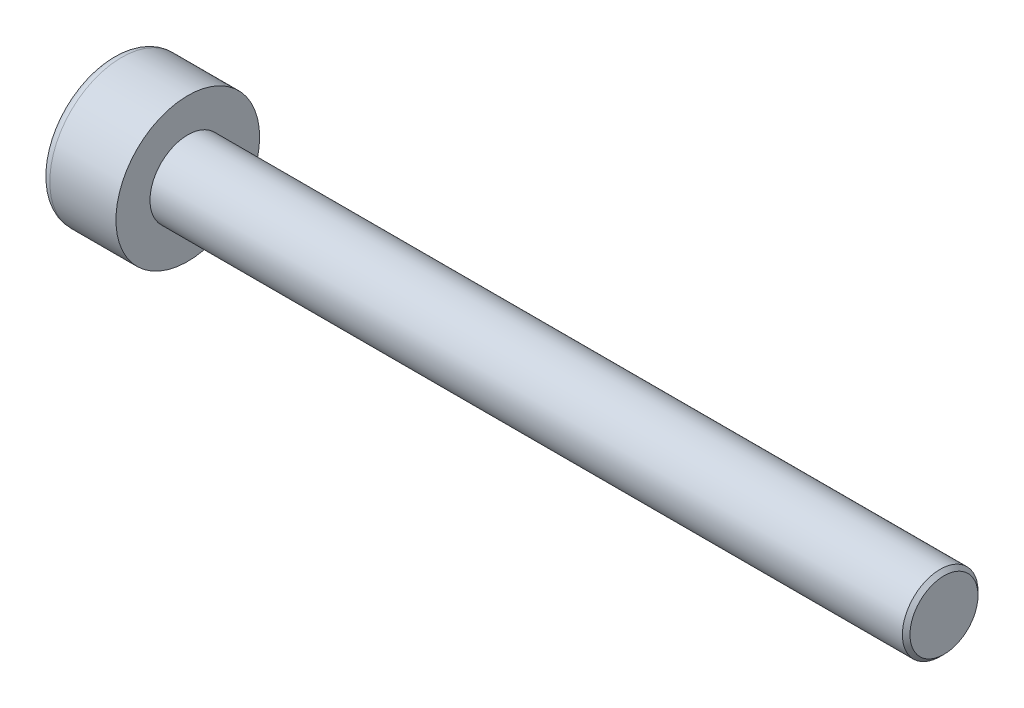
ISO-10303-21;
HEADER;
FILE_DESCRIPTION(('STEP AP214'),'2;1');
FILE_NAME('part.step','',(''),(''),'','','');
FILE_SCHEMA(('AUTOMOTIVE_DESIGN { 1 0 10303 214 1 1 1 1 }'));
ENDSEC;
DATA;
#1=APPLICATION_CONTEXT('core data for automotive mechanical design processes');
#2=APPLICATION_PROTOCOL_DEFINITION('international standard','automotive_design',2000,#1);
#3=PRODUCT_CONTEXT('',#1,'mechanical');
#4=PRODUCT('Part','Part','',(#3));
#5=PRODUCT_RELATED_PRODUCT_CATEGORY('part','',(#4));
#6=PRODUCT_DEFINITION_FORMATION('','',#4);
#7=PRODUCT_DEFINITION_CONTEXT('part definition',#1,'design');
#8=PRODUCT_DEFINITION('design','',#6,#7);
#9=PRODUCT_DEFINITION_SHAPE('','',#8);
#10=(LENGTH_UNIT() NAMED_UNIT(*) SI_UNIT(.MILLI.,.METRE.));
#11=(NAMED_UNIT(*) PLANE_ANGLE_UNIT() SI_UNIT($,.RADIAN.));
#12=(NAMED_UNIT(*) SI_UNIT($,.STERADIAN.) SOLID_ANGLE_UNIT());
#13=UNCERTAINTY_MEASURE_WITH_UNIT(LENGTH_MEASURE(1.E-05),#10,'distance_accuracy_value','');
#14=(GEOMETRIC_REPRESENTATION_CONTEXT(3) GLOBAL_UNCERTAINTY_ASSIGNED_CONTEXT((#13)) GLOBAL_UNIT_ASSIGNED_CONTEXT((#10,
#11,#12)) REPRESENTATION_CONTEXT('',''));
#15=CARTESIAN_POINT('',(0.,0.,0.));
#16=DIRECTION('',(0.,0.,1.));
#17=DIRECTION('',(1.,0.,0.));
#18=AXIS2_PLACEMENT_3D('',#15,#16,#17);
#19=CARTESIAN_POINT('',(1.,-1.5,0.));
#20=DIRECTION('',(-1.,0.,0.));
#21=DIRECTION('',(0.,0.,1.));
#22=AXIS2_PLACEMENT_3D('',#19,#20,#21);
#23=PLANE('',#22);
#24=DIRECTION('',(0.,-0.866025403784438,-0.500000000000001));
#25=VECTOR('',#24,1.);
#26=CARTESIAN_POINT('',(1.,0.,0.866025403784438));
#27=LINE('',#26,#25);
#28=CARTESIAN_POINT('',(1.,-0.375,0.649519052838328));
#29=VERTEX_POINT('',#28);
#30=CARTESIAN_POINT('',(1.,-0.749999999999999,0.433012701892218));
#31=VERTEX_POINT('',#30);
#32=EDGE_CURVE('E163',#29,#31,#27,.T.);
#33=ORIENTED_EDGE('',*,*,#32,.F.);
#34=CARTESIAN_POINT('',(1.,0.,0.));
#35=DIRECTION('',(-1.,0.,0.));
#36=DIRECTION('',(0.,0.,1.));
#37=AXIS2_PLACEMENT_3D('',#34,#35,#36);
#38=CIRCLE('',#37,0.749999999999999);
#39=CARTESIAN_POINT('',(1.,-0.749999999999999,0.));
#40=VERTEX_POINT('',#39);
#41=EDGE_CURVE('E58',#29,#40,#38,.F.);
#42=ORIENTED_EDGE('',*,*,#41,.T.);
#43=DIRECTION('',(0.,0.,-1.));
#44=VECTOR('',#43,1.);
#45=CARTESIAN_POINT('',(1.,-0.749999999999999,0.433012701892218));
#46=LINE('',#45,#44);
#47=EDGE_CURVE('E168',#31,#40,#46,.T.);
#48=ORIENTED_EDGE('',*,*,#47,.F.);
#49=EDGE_LOOP('',(#33,#42,#48));
#50=FACE_BOUND('',#49,.T.);
#51=ADVANCED_FACE('F43',(#50),#23,.T.);
#52=CARTESIAN_POINT('',(1.,-0.749999999999999,-0.433012701892221));
#53=VERTEX_POINT('',#52);
#54=EDGE_CURVE('E167',#40,#53,#46,.T.);
#55=ORIENTED_EDGE('',*,*,#54,.F.);
#56=CARTESIAN_POINT('',(1.,-0.375,-0.649519052838329));
#57=VERTEX_POINT('',#56);
#58=EDGE_CURVE('E143',#40,#57,#38,.F.);
#59=ORIENTED_EDGE('',*,*,#58,.T.);
#60=DIRECTION('',(0.,0.866025403784439,-0.5));
#61=VECTOR('',#60,1.);
#62=CARTESIAN_POINT('',(1.,-0.749999999999999,-0.433012701892221));
#63=LINE('',#62,#61);
#64=EDGE_CURVE('E151',#53,#57,#63,.T.);
#65=ORIENTED_EDGE('',*,*,#64,.F.);
#66=EDGE_LOOP('',(#55,#59,#65));
#67=FACE_BOUND('',#66,.T.);
#68=ADVANCED_FACE('F224',(#67),#23,.T.);
#69=CARTESIAN_POINT('',(1.,0.,-0.86602540378444));
#70=VERTEX_POINT('',#69);
#71=EDGE_CURVE('E141',#57,#70,#63,.T.);
#72=ORIENTED_EDGE('',*,*,#71,.F.);
#73=CARTESIAN_POINT('',(1.,0.375,-0.649519052838328));
#74=VERTEX_POINT('',#73);
#75=EDGE_CURVE('E125',#57,#74,#38,.F.);
#76=ORIENTED_EDGE('',*,*,#75,.T.);
#77=DIRECTION('',(0.,0.866025403784438,0.5));
#78=VECTOR('',#77,1.);
#79=CARTESIAN_POINT('',(1.,0.,-0.86602540378444));
#80=LINE('',#79,#78);
#81=EDGE_CURVE('E139',#70,#74,#80,.T.);
#82=ORIENTED_EDGE('',*,*,#81,.F.);
#83=EDGE_LOOP('',(#72,#76,#82));
#84=FACE_BOUND('',#83,.T.);
#85=ADVANCED_FACE('F137',(#84),#23,.T.);
#86=CARTESIAN_POINT('',(1.,0.75,-0.43301270189222));
#87=VERTEX_POINT('',#86);
#88=EDGE_CURVE('E145',#74,#87,#80,.T.);
#89=ORIENTED_EDGE('',*,*,#88,.F.);
#90=CARTESIAN_POINT('',(1.,0.,0.));
#91=DIRECTION('',(1.,0.,0.));
#92=DIRECTION('',(0.,0.,-1.));
#93=AXIS2_PLACEMENT_3D('',#90,#91,#92);
#94=CIRCLE('',#93,0.749999999999999);
#95=CARTESIAN_POINT('',(1.,0.749999999999999,0.));
#96=VERTEX_POINT('',#95);
#97=EDGE_CURVE('E123',#74,#96,#94,.T.);
#98=ORIENTED_EDGE('',*,*,#97,.T.);
#99=DIRECTION('',(0.,0.,1.));
#100=VECTOR('',#99,1.);
#101=CARTESIAN_POINT('',(1.,0.75,-0.43301270189222));
#102=LINE('',#101,#100);
#103=EDGE_CURVE('E148',#87,#96,#102,.T.);
#104=ORIENTED_EDGE('',*,*,#103,.F.);
#105=EDGE_LOOP('',(#89,#98,#104));
#106=FACE_BOUND('',#105,.T.);
#107=ADVANCED_FACE('F146',(#106),#23,.T.);
#108=CARTESIAN_POINT('',(1.,0.75,0.433012701892218));
#109=VERTEX_POINT('',#108);
#110=EDGE_CURVE('E155',#96,#109,#102,.T.);
#111=ORIENTED_EDGE('',*,*,#110,.F.);
#112=CARTESIAN_POINT('',(1.,0.375,0.649519052838328));
#113=VERTEX_POINT('',#112);
#114=EDGE_CURVE('E128',#96,#113,#38,.F.);
#115=ORIENTED_EDGE('',*,*,#114,.T.);
#116=DIRECTION('',(0.,-0.866025403784438,0.5));
#117=VECTOR('',#116,1.);
#118=CARTESIAN_POINT('',(1.,0.75,0.433012701892218));
#119=LINE('',#118,#117);
#120=EDGE_CURVE('E160',#109,#113,#119,.T.);
#121=ORIENTED_EDGE('',*,*,#120,.F.);
#122=EDGE_LOOP('',(#111,#115,#121));
#123=FACE_BOUND('',#122,.T.);
#124=ADVANCED_FACE('F236',(#123),#23,.T.);
#125=CARTESIAN_POINT('',(1.,0.,0.866025403784438));
#126=VERTEX_POINT('',#125);
#127=EDGE_CURVE('E159',#113,#126,#119,.T.);
#128=ORIENTED_EDGE('',*,*,#127,.F.);
#129=EDGE_CURVE('E204',#113,#29,#38,.F.);
#130=ORIENTED_EDGE('',*,*,#129,.T.);
#131=EDGE_CURVE('E164',#126,#29,#27,.T.);
#132=ORIENTED_EDGE('',*,*,#131,.F.);
#133=EDGE_LOOP('',(#128,#130,#132));
#134=FACE_BOUND('',#133,.T.);
#135=ADVANCED_FACE('F227',(#134),#23,.T.);
#136=CARTESIAN_POINT('',(0.,0.,0.));
#137=DIRECTION('',(1.,0.,0.));
#138=DIRECTION('',(0.,0.,-1.));
#139=AXIS2_PLACEMENT_3D('',#136,#137,#138);
#140=PLANE('',#139);
#141=CARTESIAN_POINT('',(0.,0.,0.));
#142=DIRECTION('',(1.,0.,0.));
#143=DIRECTION('',(0.,0.,-1.));
#144=AXIS2_PLACEMENT_3D('',#141,#142,#143);
#145=CIRCLE('',#144,1.65);
#146=CARTESIAN_POINT('',(0.,0.,-1.65));
#147=VERTEX_POINT('',#146);
#148=EDGE_CURVE('E209',#147,#147,#145,.F.);
#149=ORIENTED_EDGE('',*,*,#148,.T.);
#150=EDGE_LOOP('',(#149));
#151=FACE_BOUND('',#150,.T.);
#152=DIRECTION('',(0.,0.866025403784439,-0.5));
#153=VECTOR('',#152,1.);
#154=CARTESIAN_POINT('',(0.,-0.749999999999999,-0.433012701892221));
#155=LINE('',#154,#153);
#156=CARTESIAN_POINT('',(0.,-0.749999999999999,-0.433012701892221));
#157=VERTEX_POINT('',#156);
#158=CARTESIAN_POINT('',(0.,0.,-0.86602540378444));
#159=VERTEX_POINT('',#158);
#160=EDGE_CURVE('E66',#157,#159,#155,.T.);
#161=ORIENTED_EDGE('',*,*,#160,.T.);
#162=DIRECTION('',(0.,0.866025403784438,0.5));
#163=VECTOR('',#162,1.);
#164=CARTESIAN_POINT('',(0.,0.,-0.86602540378444));
#165=LINE('',#164,#163);
#166=CARTESIAN_POINT('',(0.,0.75,-0.43301270189222));
#167=VERTEX_POINT('',#166);
#168=EDGE_CURVE('E173',#159,#167,#165,.T.);
#169=ORIENTED_EDGE('',*,*,#168,.T.);
#170=DIRECTION('',(0.,0.,1.));
#171=VECTOR('',#170,1.);
#172=CARTESIAN_POINT('',(0.,0.75,-0.43301270189222));
#173=LINE('',#172,#171);
#174=CARTESIAN_POINT('',(0.,0.75,0.433012701892218));
#175=VERTEX_POINT('',#174);
#176=EDGE_CURVE('E176',#167,#175,#173,.T.);
#177=ORIENTED_EDGE('',*,*,#176,.T.);
#178=DIRECTION('',(0.,-0.866025403784438,0.5));
#179=VECTOR('',#178,1.);
#180=CARTESIAN_POINT('',(0.,0.75,0.433012701892218));
#181=LINE('',#180,#179);
#182=CARTESIAN_POINT('',(0.,0.,0.866025403784438));
#183=VERTEX_POINT('',#182);
#184=EDGE_CURVE('E179',#175,#183,#181,.T.);
#185=ORIENTED_EDGE('',*,*,#184,.T.);
#186=DIRECTION('',(0.,-0.866025403784438,-0.500000000000001));
#187=VECTOR('',#186,1.);
#188=CARTESIAN_POINT('',(0.,0.,0.866025403784438));
#189=LINE('',#188,#187);
#190=CARTESIAN_POINT('',(0.,-0.749999999999999,0.433012701892218));
#191=VERTEX_POINT('',#190);
#192=EDGE_CURVE('E182',#183,#191,#189,.T.);
#193=ORIENTED_EDGE('',*,*,#192,.T.);
#194=DIRECTION('',(0.,0.,-1.));
#195=VECTOR('',#194,1.);
#196=CARTESIAN_POINT('',(0.,-0.749999999999999,0.433012701892218));
#197=LINE('',#196,#195);
#198=EDGE_CURVE('E185',#191,#157,#197,.T.);
#199=ORIENTED_EDGE('',*,*,#198,.T.);
#200=EDGE_LOOP('',(#161,#169,#177,#185,#193,#199));
#201=FACE_BOUND('',#200,.T.);
#202=ADVANCED_FACE('F235',(#151,#201),#140,.F.);
#203=CARTESIAN_POINT('',(2.,0.,0.));
#204=DIRECTION('',(1.,0.,0.));
#205=DIRECTION('',(0.,0.,-1.));
#206=AXIS2_PLACEMENT_3D('',#203,#204,#205);
#207=PLANE('',#206);
#208=CARTESIAN_POINT('',(2.,0.,0.));
#209=DIRECTION('',(1.,0.,0.));
#210=DIRECTION('',(0.,0.,-1.));
#211=AXIS2_PLACEMENT_3D('',#208,#209,#210);
#212=CIRCLE('',#211,1.9);
#213=CARTESIAN_POINT('',(2.,0.,-1.9));
#214=VERTEX_POINT('',#213);
#215=EDGE_CURVE('E201',#214,#214,#212,.T.);
#216=ORIENTED_EDGE('',*,*,#215,.T.);
#217=EDGE_LOOP('',(#216));
#218=FACE_BOUND('',#217,.T.);
#219=CARTESIAN_POINT('',(2.,0.,0.));
#220=DIRECTION('',(1.,0.,0.));
#221=DIRECTION('',(0.,0.,-1.));
#222=AXIS2_PLACEMENT_3D('',#219,#220,#221);
#223=CIRCLE('',#222,1.);
#224=CARTESIAN_POINT('',(2.,0.,-1.));
#225=VERTEX_POINT('',#224);
#226=EDGE_CURVE('E198',#225,#225,#223,.T.);
#227=ORIENTED_EDGE('',*,*,#226,.F.);
#228=EDGE_LOOP('',(#227));
#229=FACE_BOUND('',#228,.T.);
#230=ADVANCED_FACE('F242',(#218,#229),#207,.T.);
#231=CARTESIAN_POINT('',(2.,0.,0.));
#232=DIRECTION('',(-1.,0.,0.));
#233=DIRECTION('',(0.,0.,1.));
#234=AXIS2_PLACEMENT_3D('',#231,#232,#233);
#235=CYLINDRICAL_SURFACE('',#234,1.9);
#236=CARTESIAN_POINT('',(0.25,0.,0.));
#237=DIRECTION('',(1.,0.,0.));
#238=DIRECTION('',(0.,0.,-1.));
#239=AXIS2_PLACEMENT_3D('',#236,#237,#238);
#240=CIRCLE('',#239,1.9);
#241=CARTESIAN_POINT('',(0.25,0.,-1.9));
#242=VERTEX_POINT('',#241);
#243=EDGE_CURVE('E206',#242,#242,#240,.T.);
#244=ORIENTED_EDGE('',*,*,#243,.T.);
#245=EDGE_LOOP('',(#244));
#246=FACE_BOUND('',#245,.T.);
#247=ORIENTED_EDGE('',*,*,#215,.F.);
#248=EDGE_LOOP('',(#247));
#249=FACE_BOUND('',#248,.T.);
#250=ADVANCED_FACE('F287',(#246,#249),#235,.T.);
#251=CARTESIAN_POINT('',(22.,0.,0.));
#252=DIRECTION('',(-1.,0.,0.));
#253=DIRECTION('',(0.,0.,1.));
#254=AXIS2_PLACEMENT_3D('',#251,#252,#253);
#255=CYLINDRICAL_SURFACE('',#254,1.);
#256=CARTESIAN_POINT('',(21.9,0.,0.));
#257=DIRECTION('',(1.,0.,0.));
#258=DIRECTION('',(0.,0.,-1.));
#259=AXIS2_PLACEMENT_3D('',#256,#257,#258);
#260=CIRCLE('',#259,1.);
#261=CARTESIAN_POINT('',(21.9,0.,-1.));
#262=VERTEX_POINT('',#261);
#263=EDGE_CURVE('E11',#262,#262,#260,.F.);
#264=ORIENTED_EDGE('',*,*,#263,.T.);
#265=EDGE_LOOP('',(#264));
#266=FACE_BOUND('',#265,.T.);
#267=ORIENTED_EDGE('',*,*,#226,.T.);
#268=EDGE_LOOP('',(#267));
#269=FACE_BOUND('',#268,.T.);
#270=ADVANCED_FACE('F284',(#266,#269),#255,.T.);
#271=CARTESIAN_POINT('',(22.,0.,0.));
#272=DIRECTION('',(1.,0.,0.));
#273=DIRECTION('',(0.,0.,-1.));
#274=AXIS2_PLACEMENT_3D('',#271,#272,#273);
#275=PLANE('',#274);
#276=CARTESIAN_POINT('',(22.,0.,0.));
#277=DIRECTION('',(1.,0.,0.));
#278=DIRECTION('',(0.,0.,-1.));
#279=AXIS2_PLACEMENT_3D('',#276,#277,#278);
#280=CIRCLE('',#279,0.899999999999998);
#281=CARTESIAN_POINT('',(22.,0.,-0.899999999999998));
#282=VERTEX_POINT('',#281);
#283=EDGE_CURVE('E51',#282,#282,#280,.T.);
#284=ORIENTED_EDGE('',*,*,#283,.T.);
#285=EDGE_LOOP('',(#284));
#286=FACE_BOUND('',#285,.T.);
#287=ADVANCED_FACE('F214',(#286),#275,.T.);
#288=CARTESIAN_POINT('',(1.,-0.749999999999999,-0.433012701892221));
#289=DIRECTION('',(0.,0.5,0.866025403784439));
#290=DIRECTION('',(0.,-0.866025403784439,0.5));
#291=AXIS2_PLACEMENT_3D('',#288,#289,#290);
#292=PLANE('',#291);
#293=ORIENTED_EDGE('',*,*,#160,.F.);
#294=DIRECTION('',(-1.,0.,0.));
#295=VECTOR('',#294,1.);
#296=CARTESIAN_POINT('',(1.,-0.749999999999999,-0.433012701892221));
#297=LINE('',#296,#295);
#298=EDGE_CURVE('E171',#53,#157,#297,.T.);
#299=ORIENTED_EDGE('',*,*,#298,.F.);
#300=ORIENTED_EDGE('',*,*,#64,.T.);
#301=ORIENTED_EDGE('',*,*,#71,.T.);
#302=DIRECTION('',(-1.,0.,0.));
#303=VECTOR('',#302,1.);
#304=CARTESIAN_POINT('',(1.,0.,-0.86602540378444));
#305=LINE('',#304,#303);
#306=EDGE_CURVE('E154',#70,#159,#305,.T.);
#307=ORIENTED_EDGE('',*,*,#306,.T.);
#308=EDGE_LOOP('',(#293,#299,#300,#301,#307));
#309=FACE_BOUND('',#308,.T.);
#310=ADVANCED_FACE('F258',(#309),#292,.T.);
#311=CARTESIAN_POINT('',(1.,0.,-0.86602540378444));
#312=DIRECTION('',(0.,-0.5,0.866025403784439));
#313=DIRECTION('',(0.,-0.866025403784438,-0.5));
#314=AXIS2_PLACEMENT_3D('',#311,#312,#313);
#315=PLANE('',#314);
#316=ORIENTED_EDGE('',*,*,#168,.F.);
#317=ORIENTED_EDGE('',*,*,#306,.F.);
#318=ORIENTED_EDGE('',*,*,#81,.T.);
#319=ORIENTED_EDGE('',*,*,#88,.T.);
#320=DIRECTION('',(-1.,0.,0.));
#321=VECTOR('',#320,1.);
#322=CARTESIAN_POINT('',(1.,0.75,-0.43301270189222));
#323=LINE('',#322,#321);
#324=EDGE_CURVE('E195',#87,#167,#323,.T.);
#325=ORIENTED_EDGE('',*,*,#324,.T.);
#326=EDGE_LOOP('',(#316,#317,#318,#319,#325));
#327=FACE_BOUND('',#326,.T.);
#328=ADVANCED_FACE('F153',(#327),#315,.T.);
#329=CARTESIAN_POINT('',(1.,0.75,-0.43301270189222));
#330=DIRECTION('',(0.,-1.,0.));
#331=DIRECTION('',(0.,0.,-1.));
#332=AXIS2_PLACEMENT_3D('',#329,#330,#331);
#333=PLANE('',#332);
#334=ORIENTED_EDGE('',*,*,#176,.F.);
#335=ORIENTED_EDGE('',*,*,#324,.F.);
#336=ORIENTED_EDGE('',*,*,#103,.T.);
#337=ORIENTED_EDGE('',*,*,#110,.T.);
#338=DIRECTION('',(-1.,0.,0.));
#339=VECTOR('',#338,1.);
#340=CARTESIAN_POINT('',(1.,0.75,0.433012701892218));
#341=LINE('',#340,#339);
#342=EDGE_CURVE('E193',#109,#175,#341,.T.);
#343=ORIENTED_EDGE('',*,*,#342,.T.);
#344=EDGE_LOOP('',(#334,#335,#336,#337,#343));
#345=FACE_BOUND('',#344,.T.);
#346=ADVANCED_FACE('F256',(#345),#333,.T.);
#347=CARTESIAN_POINT('',(1.,0.75,0.433012701892218));
#348=DIRECTION('',(0.,-0.5,-0.866025403784438));
#349=DIRECTION('',(0.,0.866025403784439,-0.5));
#350=AXIS2_PLACEMENT_3D('',#347,#348,#349);
#351=PLANE('',#350);
#352=ORIENTED_EDGE('',*,*,#184,.F.);
#353=ORIENTED_EDGE('',*,*,#342,.F.);
#354=ORIENTED_EDGE('',*,*,#120,.T.);
#355=ORIENTED_EDGE('',*,*,#127,.T.);
#356=DIRECTION('',(-1.,0.,0.));
#357=VECTOR('',#356,1.);
#358=CARTESIAN_POINT('',(1.,0.,0.866025403784438));
#359=LINE('',#358,#357);
#360=EDGE_CURVE('E191',#126,#183,#359,.T.);
#361=ORIENTED_EDGE('',*,*,#360,.T.);
#362=EDGE_LOOP('',(#352,#353,#354,#355,#361));
#363=FACE_BOUND('',#362,.T.);
#364=ADVANCED_FACE('F253',(#363),#351,.T.);
#365=CARTESIAN_POINT('',(1.,0.,0.866025403784438));
#366=DIRECTION('',(0.,0.500000000000001,-0.866025403784438));
#367=DIRECTION('',(0.,0.866025403784438,0.500000000000001));
#368=AXIS2_PLACEMENT_3D('',#365,#366,#367);
#369=PLANE('',#368);
#370=ORIENTED_EDGE('',*,*,#192,.F.);
#371=ORIENTED_EDGE('',*,*,#360,.F.);
#372=ORIENTED_EDGE('',*,*,#131,.T.);
#373=ORIENTED_EDGE('',*,*,#32,.T.);
#374=DIRECTION('',(-1.,0.,0.));
#375=VECTOR('',#374,1.);
#376=CARTESIAN_POINT('',(1.,-0.749999999999999,0.433012701892218));
#377=LINE('',#376,#375);
#378=EDGE_CURVE('E189',#31,#191,#377,.T.);
#379=ORIENTED_EDGE('',*,*,#378,.T.);
#380=EDGE_LOOP('',(#370,#371,#372,#373,#379));
#381=FACE_BOUND('',#380,.T.);
#382=ADVANCED_FACE('F267',(#381),#369,.T.);
#383=CARTESIAN_POINT('',(1.,-0.749999999999999,0.433012701892218));
#384=DIRECTION('',(0.,1.,0.));
#385=DIRECTION('',(0.,0.,1.));
#386=AXIS2_PLACEMENT_3D('',#383,#384,#385);
#387=PLANE('',#386);
#388=ORIENTED_EDGE('',*,*,#198,.F.);
#389=ORIENTED_EDGE('',*,*,#378,.F.);
#390=ORIENTED_EDGE('',*,*,#47,.T.);
#391=ORIENTED_EDGE('',*,*,#54,.T.);
#392=ORIENTED_EDGE('',*,*,#298,.T.);
#393=EDGE_LOOP('',(#388,#389,#390,#391,#392));
#394=FACE_BOUND('',#393,.T.);
#395=ADVANCED_FACE('F120',(#394),#387,.T.);
#396=CARTESIAN_POINT('',(1.,0.,0.));
#397=DIRECTION('',(-1.,0.,0.));
#398=DIRECTION('',(0.,0.,1.));
#399=AXIS2_PLACEMENT_3D('',#396,#397,#398);
#400=CONICAL_SURFACE('',#399,0.749999999999999,1.04719755119659);
#401=CARTESIAN_POINT('',(1.43301270189222,0.,0.));
#402=VERTEX_POINT('',#401);
#403=VERTEX_LOOP('',#402);
#404=FACE_BOUND('',#403,.T.);
#405=ORIENTED_EDGE('',*,*,#97,.F.);
#406=ORIENTED_EDGE('',*,*,#75,.F.);
#407=ORIENTED_EDGE('',*,*,#58,.F.);
#408=ORIENTED_EDGE('',*,*,#41,.F.);
#409=ORIENTED_EDGE('',*,*,#129,.F.);
#410=ORIENTED_EDGE('',*,*,#114,.F.);
#411=EDGE_LOOP('',(#405,#406,#407,#408,#409,#410));
#412=FACE_BOUND('',#411,.T.);
#413=ADVANCED_FACE('F117',(#404,#412),#400,.F.);
#414=CARTESIAN_POINT('',(0.25,0.,0.));
#415=DIRECTION('',(1.,0.,0.));
#416=DIRECTION('',(0.,0.,-1.));
#417=AXIS2_PLACEMENT_3D('',#414,#415,#416);
#418=TOROIDAL_SURFACE('',#417,1.65,0.25);
#419=ORIENTED_EDGE('',*,*,#148,.F.);
#420=EDGE_LOOP('',(#419));
#421=FACE_BOUND('',#420,.T.);
#422=ORIENTED_EDGE('',*,*,#243,.F.);
#423=EDGE_LOOP('',(#422));
#424=FACE_BOUND('',#423,.T.);
#425=ADVANCED_FACE('F119',(#421,#424),#418,.T.);
#426=CARTESIAN_POINT('',(22.,0.,0.));
#427=DIRECTION('',(-1.,0.,0.));
#428=DIRECTION('',(0.,0.,1.));
#429=AXIS2_PLACEMENT_3D('',#426,#427,#428);
#430=CONICAL_SURFACE('',#429,0.899999999999998,0.785398163397479);
#431=ORIENTED_EDGE('',*,*,#263,.F.);
#432=EDGE_LOOP('',(#431));
#433=FACE_BOUND('',#432,.T.);
#434=ORIENTED_EDGE('',*,*,#283,.F.);
#435=EDGE_LOOP('',(#434));
#436=FACE_BOUND('',#435,.T.);
#437=ADVANCED_FACE('F45',(#433,#436),#430,.T.);
#438=CLOSED_SHELL('',(#51,#68,#85,#107,#124,#135,#202,#230,#250,#270,#287,#310,#328,#346,#364,
#382,#395,#413,#425,#437));
#439=MANIFOLD_SOLID_BREP('B2',#438);
#440=ADVANCED_BREP_SHAPE_REPRESENTATION('',(#18,#439),#14);
#441=SHAPE_DEFINITION_REPRESENTATION(#9,#440);
ENDSEC;
END-ISO-10303-21;
